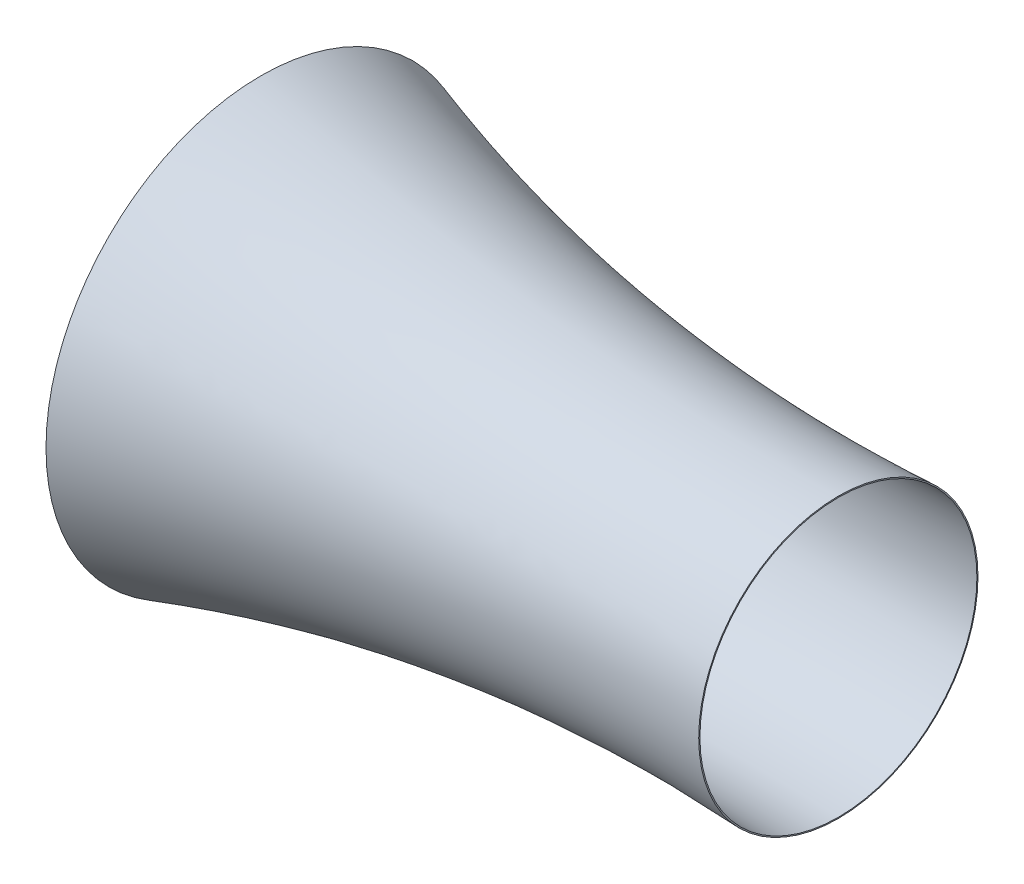
ISO-10303-21;
HEADER;
FILE_DESCRIPTION(('STEP AP214'),'2;1');
FILE_NAME('part.step','',(''),(''),'','','');
FILE_SCHEMA(('AUTOMOTIVE_DESIGN { 1 0 10303 214 1 1 1 1 }'));
ENDSEC;
DATA;
#1=APPLICATION_CONTEXT('core data for automotive mechanical design processes');
#2=APPLICATION_PROTOCOL_DEFINITION('international standard','automotive_design',2000,#1);
#3=PRODUCT_CONTEXT('',#1,'mechanical');
#4=PRODUCT('Part','Part','',(#3));
#5=PRODUCT_RELATED_PRODUCT_CATEGORY('part','',(#4));
#6=PRODUCT_DEFINITION_FORMATION('','',#4);
#7=PRODUCT_DEFINITION_CONTEXT('part definition',#1,'design');
#8=PRODUCT_DEFINITION('design','',#6,#7);
#9=PRODUCT_DEFINITION_SHAPE('','',#8);
#10=(LENGTH_UNIT() NAMED_UNIT(*) SI_UNIT(.MILLI.,.METRE.));
#11=(NAMED_UNIT(*) PLANE_ANGLE_UNIT() SI_UNIT($,.RADIAN.));
#12=(NAMED_UNIT(*) SI_UNIT($,.STERADIAN.) SOLID_ANGLE_UNIT());
#13=UNCERTAINTY_MEASURE_WITH_UNIT(LENGTH_MEASURE(1.E-05),#10,'distance_accuracy_value','');
#14=(GEOMETRIC_REPRESENTATION_CONTEXT(3) GLOBAL_UNCERTAINTY_ASSIGNED_CONTEXT((#13)) GLOBAL_UNIT_ASSIGNED_CONTEXT((#10,
#11,#12)) REPRESENTATION_CONTEXT('',''));
#15=CARTESIAN_POINT('',(0.,0.,0.));
#16=DIRECTION('',(0.,0.,1.));
#17=DIRECTION('',(1.,0.,0.));
#18=AXIS2_PLACEMENT_3D('',#15,#16,#17);
#19=CARTESIAN_POINT('',(58.1645223558109,0.,0.));
#20=DIRECTION('',(-1.,0.,0.));
#21=DIRECTION('',(0.,0.,1.));
#22=AXIS2_PLACEMENT_3D('',#19,#20,#21);
#23=PLANE('',#22);
#24=CARTESIAN_POINT('',(58.1645223558109,0.,0.));
#25=DIRECTION('',(1.,0.,0.));
#26=DIRECTION('',(0.,0.,-1.));
#27=AXIS2_PLACEMENT_3D('',#24,#25,#26);
#28=CIRCLE('',#27,825.);
#29=CARTESIAN_POINT('',(58.1645223558109,0.,-825.));
#30=VERTEX_POINT('',#29);
#31=EDGE_CURVE('E51',#30,#30,#28,.T.);
#32=ORIENTED_EDGE('',*,*,#31,.F.);
#33=EDGE_LOOP('',(#32));
#34=FACE_BOUND('',#33,.T.);
#35=CARTESIAN_POINT('',(58.1645223558109,0.,0.));
#36=DIRECTION('',(1.,0.,0.));
#37=DIRECTION('',(0.,0.,-1.));
#38=AXIS2_PLACEMENT_3D('',#35,#36,#37);
#39=CIRCLE('',#38,830.);
#40=CARTESIAN_POINT('',(58.1645223558109,0.,-830.));
#41=VERTEX_POINT('',#40);
#42=EDGE_CURVE('E114',#41,#41,#39,.T.);
#43=ORIENTED_EDGE('',*,*,#42,.T.);
#44=EDGE_LOOP('',(#43));
#45=FACE_BOUND('',#44,.T.);
#46=ADVANCED_FACE('F33',(#34,#45),#23,.F.);
#47=CARTESIAN_POINT('',(2500.,0.,0.));
#48=DIRECTION('',(-1.,0.,0.));
#49=DIRECTION('',(0.,0.,1.));
#50=AXIS2_PLACEMENT_3D('',#47,#48,#49);
#51=CONICAL_SURFACE('',#50,600.,1.52061028692374);
#52=CARTESIAN_POINT('',(2499.74917512113,0.,0.));
#53=DIRECTION('',(1.,0.,0.));
#54=DIRECTION('',(0.,1.,0.));
#55=AXIS2_PLACEMENT_3D('',#52,#53,#54);
#56=CIRCLE('',#55,604.993704724965);
#57=CARTESIAN_POINT('',(2499.74917512113,604.993704724965,0.));
#58=VERTEX_POINT('',#57);
#59=EDGE_CURVE('E10',#58,#58,#56,.T.);
#60=ORIENTED_EDGE('',*,*,#59,.T.);
#61=EDGE_LOOP('',(#60));
#62=FACE_BOUND('',#61,.T.);
#63=CARTESIAN_POINT('',(2500.,0.,0.));
#64=DIRECTION('',(1.,0.,0.));
#65=DIRECTION('',(0.,0.,-1.));
#66=AXIS2_PLACEMENT_3D('',#63,#64,#65);
#67=CIRCLE('',#66,600.);
#68=CARTESIAN_POINT('',(2500.,0.,-600.));
#69=VERTEX_POINT('',#68);
#70=EDGE_CURVE('E36',#69,#69,#67,.T.);
#71=ORIENTED_EDGE('',*,*,#70,.F.);
#72=EDGE_LOOP('',(#71));
#73=FACE_BOUND('',#72,.T.);
#74=ADVANCED_FACE('F150',(#62,#73),#51,.T.);
#75=CARTESIAN_POINT('',(2500.,600.,0.));
#76=CARTESIAN_POINT('',(1213.17548755446,535.365100613493,0.));
#77=CARTESIAN_POINT('',(-12.1317548755446,928.720662531204,0.));
#78=CARTESIAN_POINT('',(-24.2635097510892,932.615272055142,0.));
#79=B_SPLINE_CURVE_WITH_KNOTS('',2,(#75,#76,#77,#78),.UNSPECIFIED.,.F.,.F.,(3,1,3),(0.,1.,1.01),.UNSPECIFIED.);
#80=CARTESIAN_POINT('',(0.,0.,0.));
#81=DIRECTION('',(1.,0.,0.));
#82=AXIS1_PLACEMENT('',#80,#81);
#83=SURFACE_OF_REVOLUTION('',#79,#82);
#84=OFFSET_SURFACE('',#83,-5.,.F.);
#85=CARTESIAN_POINT('',(-2.20445294947292,0.,0.));
#86=DIRECTION('',(1.,0.,0.));
#87=DIRECTION('',(0.,0.,-1.));
#88=AXIS2_PLACEMENT_3D('',#85,#86,#87);
#89=CIRCLE('',#88,930.785067632649);
#90=CARTESIAN_POINT('',(-2.20445294947292,0.,-930.785067632649));
#91=VERTEX_POINT('',#90);
#92=EDGE_CURVE('E40',#91,#91,#89,.T.);
#93=ORIENTED_EDGE('',*,*,#92,.T.);
#94=EDGE_LOOP('',(#93));
#95=FACE_BOUND('',#94,.T.);
#96=ORIENTED_EDGE('',*,*,#59,.F.);
#97=EDGE_LOOP('',(#96));
#98=FACE_BOUND('',#97,.T.);
#99=ADVANCED_FACE('F70',(#95,#98),#84,.F.);
#100=CARTESIAN_POINT('',(2.05420285851664,928.165172461259,0.));
#101=CARTESIAN_POINT('',(1.02710142925832,926.495612734263,0.));
#102=CARTESIAN_POINT('',(-40.6448771597789,858.757553751386,0.));
#103=CARTESIAN_POINT('',(0.745532448811899,798.922234092078,0.));
#104=CARTESIAN_POINT('',(1.4910648976238,797.844468184157,0.));
#105=B_SPLINE_CURVE_WITH_KNOTS('',2,(#100,#101,#102,#103,#104),.UNSPECIFIED.,.F.,.F.,(3,1,1,3),
(-0.0252701324504116,0.,1.,1.01834259323459),.UNSPECIFIED.);
#106=CARTESIAN_POINT('',(0.,0.,0.));
#107=DIRECTION('',(1.,0.,0.));
#108=AXIS1_PLACEMENT('',#106,#107);
#109=SURFACE_OF_REVOLUTION('',#105,#108);
#110=OFFSET_SURFACE('',#109,-5.,.F.);
#111=CARTESIAN_POINT('',(-2.62099064058559,0.,0.));
#112=DIRECTION('',(1.,0.,0.));
#113=DIRECTION('',(0.,0.,-1.));
#114=AXIS2_PLACEMENT_3D('',#111,#112,#113);
#115=CIRCLE('',#114,795.);
#116=CARTESIAN_POINT('',(-2.62099064058559,0.,-795.));
#117=VERTEX_POINT('',#116);
#118=EDGE_CURVE('E45',#117,#117,#115,.T.);
#119=ORIENTED_EDGE('',*,*,#118,.T.);
#120=EDGE_LOOP('',(#119));
#121=FACE_BOUND('',#120,.T.);
#122=ORIENTED_EDGE('',*,*,#92,.F.);
#123=EDGE_LOOP('',(#122));
#124=FACE_BOUND('',#123,.T.);
#125=ADVANCED_FACE('F71',(#121,#124),#110,.F.);
#126=CARTESIAN_POINT('',(0.,0.,0.));
#127=DIRECTION('',(1.,0.,0.));
#128=DIRECTION('',(0.,0.,-1.));
#129=AXIS2_PLACEMENT_3D('',#126,#127,#128);
#130=CYLINDRICAL_SURFACE('',#129,795.);
#131=CARTESIAN_POINT('',(28.8211041168073,0.,0.));
#132=DIRECTION('',(1.,0.,0.));
#133=DIRECTION('',(0.,0.,-1.));
#134=AXIS2_PLACEMENT_3D('',#131,#132,#133);
#135=CIRCLE('',#134,795.);
#136=CARTESIAN_POINT('',(28.8211041168073,0.,-795.));
#137=VERTEX_POINT('',#136);
#138=EDGE_CURVE('E54',#137,#137,#135,.T.);
#139=ORIENTED_EDGE('',*,*,#138,.T.);
#140=EDGE_LOOP('',(#139));
#141=FACE_BOUND('',#140,.T.);
#142=ORIENTED_EDGE('',*,*,#118,.F.);
#143=EDGE_LOOP('',(#142));
#144=FACE_BOUND('',#143,.T.);
#145=ADVANCED_FACE('F74',(#141,#144),#130,.F.);
#146=CARTESIAN_POINT('',(29.8245244772304,0.,0.));
#147=DIRECTION('',(1.,0.,0.));
#148=DIRECTION('',(0.,0.,-1.));
#149=AXIS2_PLACEMENT_3D('',#146,#147,#148);
#150=CONICAL_SURFACE('',#149,798.687002068317,1.30508097022597);
#151=CARTESIAN_POINT('',(36.9856264726182,0.,0.));
#152=DIRECTION('',(1.,0.,0.));
#153=DIRECTION('',(0.,0.,-1.));
#154=AXIS2_PLACEMENT_3D('',#151,#152,#153);
#155=CIRCLE('',#154,825.);
#156=CARTESIAN_POINT('',(36.9856264726182,0.,-825.));
#157=VERTEX_POINT('',#156);
#158=EDGE_CURVE('E49',#157,#157,#155,.T.);
#159=ORIENTED_EDGE('',*,*,#158,.T.);
#160=EDGE_LOOP('',(#159));
#161=FACE_BOUND('',#160,.T.);
#162=ORIENTED_EDGE('',*,*,#138,.F.);
#163=EDGE_LOOP('',(#162));
#164=FACE_BOUND('',#163,.T.);
#165=ADVANCED_FACE('F80',(#161,#164),#150,.F.);
#166=CARTESIAN_POINT('',(0.,0.,0.));
#167=DIRECTION('',(1.,0.,0.));
#168=DIRECTION('',(0.,0.,-1.));
#169=AXIS2_PLACEMENT_3D('',#166,#167,#168);
#170=CYLINDRICAL_SURFACE('',#169,825.);
#171=ORIENTED_EDGE('',*,*,#31,.T.);
#172=EDGE_LOOP('',(#171));
#173=FACE_BOUND('',#172,.T.);
#174=ORIENTED_EDGE('',*,*,#158,.F.);
#175=EDGE_LOOP('',(#174));
#176=FACE_BOUND('',#175,.T.);
#177=ADVANCED_FACE('F84',(#173,#176),#170,.F.);
#178=CARTESIAN_POINT('',(2500.,600.,0.));
#179=CARTESIAN_POINT('',(1213.17548755446,535.365100613493,0.));
#180=CARTESIAN_POINT('',(0.,924.826053007267,0.));
#181=B_SPLINE_CURVE_WITH_KNOTS('',2,(#178,#179,#180),.UNSPECIFIED.,.F.,.F.,(3,3),(0.,1.),.UNSPECIFIED.);
#182=CARTESIAN_POINT('',(0.,0.,0.));
#183=DIRECTION('',(1.,0.,0.));
#184=AXIS1_PLACEMENT('',#182,#183);
#185=SURFACE_OF_REVOLUTION('',#181,#184);
#186=CARTESIAN_POINT('',(0.,0.,0.));
#187=DIRECTION('',(1.,0.,0.));
#188=DIRECTION('',(0.,0.,-1.));
#189=AXIS2_PLACEMENT_3D('',#186,#187,#188);
#190=CIRCLE('',#189,924.826053007267);
#191=CARTESIAN_POINT('',(0.,0.,-924.826053007267));
#192=VERTEX_POINT('',#191);
#193=EDGE_CURVE('E128',#192,#192,#190,.T.);
#194=ORIENTED_EDGE('',*,*,#193,.F.);
#195=EDGE_LOOP('',(#194));
#196=FACE_BOUND('',#195,.T.);
#197=ORIENTED_EDGE('',*,*,#70,.T.);
#198=EDGE_LOOP('',(#197));
#199=FACE_BOUND('',#198,.T.);
#200=ADVANCED_FACE('F88',(#196,#199),#185,.T.);
#201=CARTESIAN_POINT('',(0.,924.826053007267,0.));
#202=CARTESIAN_POINT('',(-40.6448771597789,858.757553751386,0.));
#203=CARTESIAN_POINT('',(0.,800.,0.));
#204=B_SPLINE_CURVE_WITH_KNOTS('',2,(#201,#202,#203),.UNSPECIFIED.,.F.,.F.,(3,3),(0.,1.),.UNSPECIFIED.);
#205=CARTESIAN_POINT('',(0.,0.,0.));
#206=DIRECTION('',(1.,0.,0.));
#207=AXIS1_PLACEMENT('',#205,#206);
#208=SURFACE_OF_REVOLUTION('',#204,#207);
#209=CARTESIAN_POINT('',(0.,0.,0.));
#210=DIRECTION('',(1.,0.,0.));
#211=DIRECTION('',(0.,0.,-1.));
#212=AXIS2_PLACEMENT_3D('',#209,#210,#211);
#213=CIRCLE('',#212,800.);
#214=CARTESIAN_POINT('',(0.,0.,-800.));
#215=VERTEX_POINT('',#214);
#216=EDGE_CURVE('E126',#215,#215,#213,.T.);
#217=ORIENTED_EDGE('',*,*,#216,.F.);
#218=EDGE_LOOP('',(#217));
#219=FACE_BOUND('',#218,.T.);
#220=ORIENTED_EDGE('',*,*,#193,.T.);
#221=EDGE_LOOP('',(#220));
#222=FACE_BOUND('',#221,.T.);
#223=ADVANCED_FACE('F101',(#219,#222),#208,.T.);
#224=CARTESIAN_POINT('',(0.,0.,0.));
#225=DIRECTION('',(1.,0.,0.));
#226=DIRECTION('',(0.,0.,-1.));
#227=AXIS2_PLACEMENT_3D('',#224,#225,#226);
#228=CYLINDRICAL_SURFACE('',#227,800.);
#229=CARTESIAN_POINT('',(25.,0.,0.));
#230=DIRECTION('',(1.,0.,0.));
#231=DIRECTION('',(0.,0.,-1.));
#232=AXIS2_PLACEMENT_3D('',#229,#230,#231);
#233=CIRCLE('',#232,800.);
#234=CARTESIAN_POINT('',(25.,0.,-800.));
#235=VERTEX_POINT('',#234);
#236=EDGE_CURVE('E120',#235,#235,#233,.T.);
#237=ORIENTED_EDGE('',*,*,#236,.F.);
#238=EDGE_LOOP('',(#237));
#239=FACE_BOUND('',#238,.T.);
#240=ORIENTED_EDGE('',*,*,#216,.T.);
#241=EDGE_LOOP('',(#240));
#242=FACE_BOUND('',#241,.T.);
#243=ADVANCED_FACE('F97',(#239,#242),#228,.T.);
#244=CARTESIAN_POINT('',(25.,0.,0.));
#245=DIRECTION('',(1.,0.,0.));
#246=DIRECTION('',(0.,0.,-1.));
#247=AXIS2_PLACEMENT_3D('',#244,#245,#246);
#248=CONICAL_SURFACE('',#247,800.,1.30508097022597);
#249=CARTESIAN_POINT('',(33.1645223558109,0.,0.));
#250=DIRECTION('',(1.,0.,0.));
#251=DIRECTION('',(0.,0.,-1.));
#252=AXIS2_PLACEMENT_3D('',#249,#250,#251);
#253=CIRCLE('',#252,830.);
#254=CARTESIAN_POINT('',(33.1645223558109,0.,-830.));
#255=VERTEX_POINT('',#254);
#256=EDGE_CURVE('E121',#255,#255,#253,.T.);
#257=ORIENTED_EDGE('',*,*,#256,.F.);
#258=EDGE_LOOP('',(#257));
#259=FACE_BOUND('',#258,.T.);
#260=ORIENTED_EDGE('',*,*,#236,.T.);
#261=EDGE_LOOP('',(#260));
#262=FACE_BOUND('',#261,.T.);
#263=ADVANCED_FACE('F93',(#259,#262),#248,.T.);
#264=CARTESIAN_POINT('',(0.,0.,0.));
#265=DIRECTION('',(1.,0.,0.));
#266=DIRECTION('',(0.,0.,-1.));
#267=AXIS2_PLACEMENT_3D('',#264,#265,#266);
#268=CYLINDRICAL_SURFACE('',#267,830.);
#269=ORIENTED_EDGE('',*,*,#42,.F.);
#270=EDGE_LOOP('',(#269));
#271=FACE_BOUND('',#270,.T.);
#272=ORIENTED_EDGE('',*,*,#256,.T.);
#273=EDGE_LOOP('',(#272));
#274=FACE_BOUND('',#273,.T.);
#275=ADVANCED_FACE('F90',(#271,#274),#268,.T.);
#276=CLOSED_SHELL('',(#46,#74,#99,#125,#145,#165,#177,#200,#223,#243,#263,#275));
#277=MANIFOLD_SOLID_BREP('B2',#276);
#278=ADVANCED_BREP_SHAPE_REPRESENTATION('',(#18,#277),#14);
#279=SHAPE_DEFINITION_REPRESENTATION(#9,#278);
ENDSEC;
END-ISO-10303-21;
